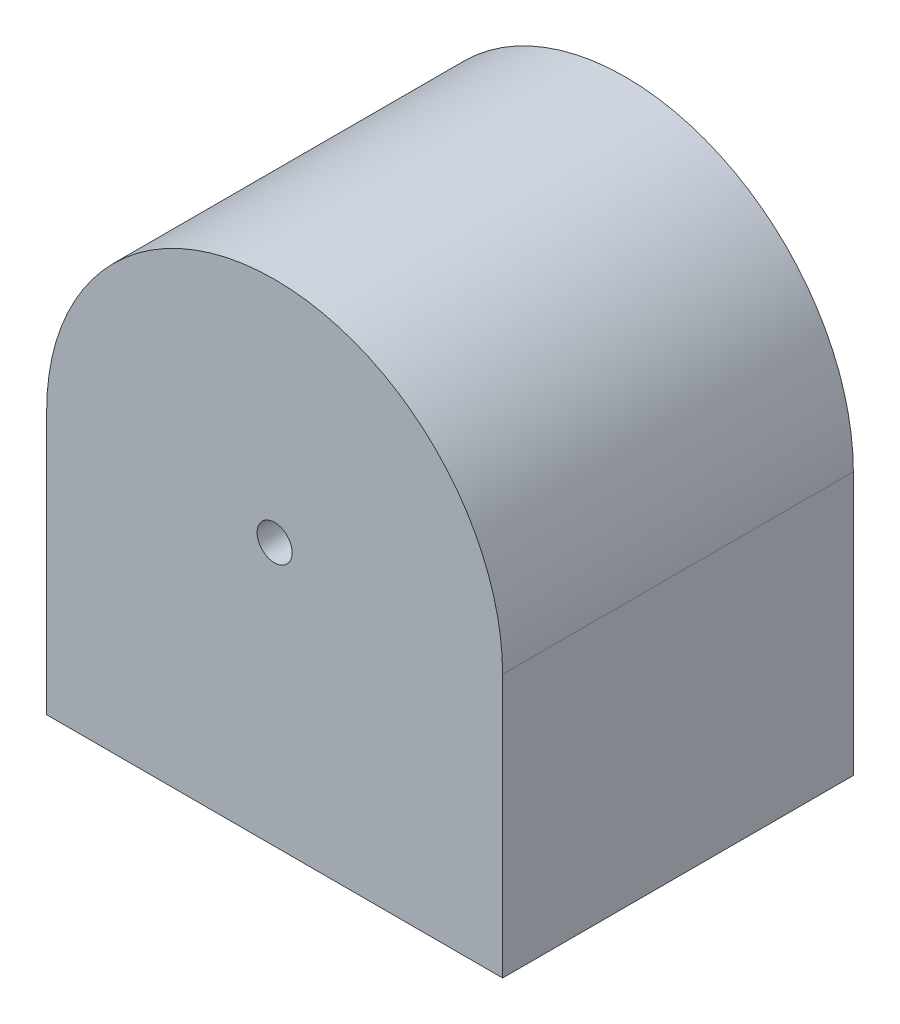
ISO-10303-21;
HEADER;
FILE_DESCRIPTION(('STEP AP214'),'2;1');
FILE_NAME('part.step','',(''),(''),'','','');
FILE_SCHEMA(('AUTOMOTIVE_DESIGN { 1 0 10303 214 1 1 1 1 }'));
ENDSEC;
DATA;
#1=APPLICATION_CONTEXT('core data for automotive mechanical design processes');
#2=APPLICATION_PROTOCOL_DEFINITION('international standard','automotive_design',2000,#1);
#3=PRODUCT_CONTEXT('',#1,'mechanical');
#4=PRODUCT('Part','Part','',(#3));
#5=PRODUCT_RELATED_PRODUCT_CATEGORY('part','',(#4));
#6=PRODUCT_DEFINITION_FORMATION('','',#4);
#7=PRODUCT_DEFINITION_CONTEXT('part definition',#1,'design');
#8=PRODUCT_DEFINITION('design','',#6,#7);
#9=PRODUCT_DEFINITION_SHAPE('','',#8);
#10=(LENGTH_UNIT() NAMED_UNIT(*) SI_UNIT(.MILLI.,.METRE.));
#11=(NAMED_UNIT(*) PLANE_ANGLE_UNIT() SI_UNIT($,.RADIAN.));
#12=(NAMED_UNIT(*) SI_UNIT($,.STERADIAN.) SOLID_ANGLE_UNIT());
#13=UNCERTAINTY_MEASURE_WITH_UNIT(LENGTH_MEASURE(1.E-05),#10,'distance_accuracy_value','');
#14=(GEOMETRIC_REPRESENTATION_CONTEXT(3) GLOBAL_UNCERTAINTY_ASSIGNED_CONTEXT((#13)) GLOBAL_UNIT_ASSIGNED_CONTEXT((#10,
#11,#12)) REPRESENTATION_CONTEXT('',''));
#15=CARTESIAN_POINT('',(0.,0.,0.));
#16=DIRECTION('',(0.,0.,1.));
#17=DIRECTION('',(1.,0.,0.));
#18=AXIS2_PLACEMENT_3D('',#15,#16,#17);
#19=CARTESIAN_POINT('',(0.,-75.,100.));
#20=DIRECTION('',(0.,1.,0.));
#21=DIRECTION('',(0.,0.,1.));
#22=AXIS2_PLACEMENT_3D('',#19,#20,#21);
#23=PLANE('',#22);
#24=DIRECTION('',(1.,0.,0.));
#25=VECTOR('',#24,1.);
#26=CARTESIAN_POINT('',(0.,-75.,0.));
#27=LINE('',#26,#25);
#28=CARTESIAN_POINT('',(-65.,-75.,0.));
#29=VERTEX_POINT('',#28);
#30=CARTESIAN_POINT('',(65.,-75.,0.));
#31=VERTEX_POINT('',#30);
#32=EDGE_CURVE('E91',#29,#31,#27,.T.);
#33=ORIENTED_EDGE('',*,*,#32,.T.);
#34=DIRECTION('',(0.,0.,-1.));
#35=VECTOR('',#34,1.);
#36=CARTESIAN_POINT('',(65.,-75.,100.));
#37=LINE('',#36,#35);
#38=CARTESIAN_POINT('',(65.,-75.,100.));
#39=VERTEX_POINT('',#38);
#40=EDGE_CURVE('E11',#39,#31,#37,.T.);
#41=ORIENTED_EDGE('',*,*,#40,.F.);
#42=DIRECTION('',(-1.,0.,0.));
#43=VECTOR('',#42,1.);
#44=CARTESIAN_POINT('',(0.,-75.,100.));
#45=LINE('',#44,#43);
#46=CARTESIAN_POINT('',(-65.,-75.,100.));
#47=VERTEX_POINT('',#46);
#48=EDGE_CURVE('E172',#39,#47,#45,.T.);
#49=ORIENTED_EDGE('',*,*,#48,.T.);
#50=DIRECTION('',(0.,0.,-1.));
#51=VECTOR('',#50,1.);
#52=CARTESIAN_POINT('',(-65.,-75.,100.));
#53=LINE('',#52,#51);
#54=EDGE_CURVE('E96',#47,#29,#53,.T.);
#55=ORIENTED_EDGE('',*,*,#54,.T.);
#56=EDGE_LOOP('',(#33,#41,#49,#55));
#57=FACE_BOUND('',#56,.T.);
#58=DIRECTION('',(1.,0.,0.));
#59=VECTOR('',#58,1.);
#60=CARTESIAN_POINT('',(0.,-75.,9.99999999999999));
#61=LINE('',#60,#59);
#62=CARTESIAN_POINT('',(-55.,-75.,10.));
#63=VERTEX_POINT('',#62);
#64=CARTESIAN_POINT('',(55.,-75.,10.));
#65=VERTEX_POINT('',#64);
#66=EDGE_CURVE('E125',#63,#65,#61,.T.);
#67=ORIENTED_EDGE('',*,*,#66,.F.);
#68=DIRECTION('',(0.,0.,-1.));
#69=VECTOR('',#68,1.);
#70=CARTESIAN_POINT('',(-55.,-75.,100.));
#71=LINE('',#70,#69);
#72=CARTESIAN_POINT('',(-55.,-75.,90.));
#73=VERTEX_POINT('',#72);
#74=EDGE_CURVE('E155',#73,#63,#71,.T.);
#75=ORIENTED_EDGE('',*,*,#74,.F.);
#76=DIRECTION('',(-1.,0.,0.));
#77=VECTOR('',#76,1.);
#78=CARTESIAN_POINT('',(0.,-75.,90.));
#79=LINE('',#78,#77);
#80=CARTESIAN_POINT('',(55.,-75.,90.));
#81=VERTEX_POINT('',#80);
#82=EDGE_CURVE('E61',#81,#73,#79,.T.);
#83=ORIENTED_EDGE('',*,*,#82,.F.);
#84=DIRECTION('',(0.,0.,-1.));
#85=VECTOR('',#84,1.);
#86=CARTESIAN_POINT('',(55.,-75.,100.));
#87=LINE('',#86,#85);
#88=EDGE_CURVE('E139',#81,#65,#87,.T.);
#89=ORIENTED_EDGE('',*,*,#88,.T.);
#90=EDGE_LOOP('',(#67,#75,#83,#89));
#91=FACE_BOUND('',#90,.T.);
#92=ADVANCED_FACE('F43',(#57,#91),#23,.F.);
#93=CARTESIAN_POINT('',(65.,-75.,100.));
#94=DIRECTION('',(-1.,0.,0.));
#95=DIRECTION('',(0.,0.,1.));
#96=AXIS2_PLACEMENT_3D('',#93,#94,#95);
#97=PLANE('',#96);
#98=DIRECTION('',(0.,1.,0.));
#99=VECTOR('',#98,1.);
#100=CARTESIAN_POINT('',(65.,-75.,0.));
#101=LINE('',#100,#99);
#102=CARTESIAN_POINT('',(65.,0.,0.));
#103=VERTEX_POINT('',#102);
#104=EDGE_CURVE('E190',#31,#103,#101,.T.);
#105=ORIENTED_EDGE('',*,*,#104,.T.);
#106=DIRECTION('',(0.,0.,-1.));
#107=VECTOR('',#106,1.);
#108=CARTESIAN_POINT('',(65.,0.,100.));
#109=LINE('',#108,#107);
#110=CARTESIAN_POINT('',(65.,0.,100.));
#111=VERTEX_POINT('',#110);
#112=EDGE_CURVE('E53',#111,#103,#109,.T.);
#113=ORIENTED_EDGE('',*,*,#112,.F.);
#114=DIRECTION('',(0.,1.,0.));
#115=VECTOR('',#114,1.);
#116=CARTESIAN_POINT('',(65.,-65.,100.));
#117=LINE('',#116,#115);
#118=EDGE_CURVE('E69',#39,#111,#117,.T.);
#119=ORIENTED_EDGE('',*,*,#118,.F.);
#120=ORIENTED_EDGE('',*,*,#40,.T.);
#121=EDGE_LOOP('',(#105,#113,#119,#120));
#122=FACE_BOUND('',#121,.T.);
#123=ADVANCED_FACE('F213',(#122),#97,.F.);
#124=CARTESIAN_POINT('',(0.,0.,100.));
#125=DIRECTION('',(0.,0.,-1.));
#126=DIRECTION('',(-1.,0.,0.));
#127=AXIS2_PLACEMENT_3D('',#124,#125,#126);
#128=CYLINDRICAL_SURFACE('',#127,65.);
#129=CARTESIAN_POINT('',(0.,0.,0.));
#130=DIRECTION('',(0.,0.,1.));
#131=DIRECTION('',(1.,0.,0.));
#132=AXIS2_PLACEMENT_3D('',#129,#130,#131);
#133=CIRCLE('',#132,65.);
#134=CARTESIAN_POINT('',(-65.,0.,0.));
#135=VERTEX_POINT('',#134);
#136=EDGE_CURVE('E187',#103,#135,#133,.T.);
#137=ORIENTED_EDGE('',*,*,#136,.T.);
#138=DIRECTION('',(0.,0.,-1.));
#139=VECTOR('',#138,1.);
#140=CARTESIAN_POINT('',(-65.,0.,100.));
#141=LINE('',#140,#139);
#142=CARTESIAN_POINT('',(-65.,0.,100.));
#143=VERTEX_POINT('',#142);
#144=EDGE_CURVE('E198',#143,#135,#141,.T.);
#145=ORIENTED_EDGE('',*,*,#144,.F.);
#146=CARTESIAN_POINT('',(0.,0.,100.));
#147=DIRECTION('',(0.,0.,1.));
#148=DIRECTION('',(1.,0.,0.));
#149=AXIS2_PLACEMENT_3D('',#146,#147,#148);
#150=CIRCLE('',#149,65.);
#151=EDGE_CURVE('E179',#111,#143,#150,.T.);
#152=ORIENTED_EDGE('',*,*,#151,.F.);
#153=ORIENTED_EDGE('',*,*,#112,.T.);
#154=EDGE_LOOP('',(#137,#145,#152,#153));
#155=FACE_BOUND('',#154,.T.);
#156=ADVANCED_FACE('F214',(#155),#128,.T.);
#157=CARTESIAN_POINT('',(-65.,0.,100.));
#158=DIRECTION('',(1.,0.,0.));
#159=DIRECTION('',(0.,0.,-1.));
#160=AXIS2_PLACEMENT_3D('',#157,#158,#159);
#161=PLANE('',#160);
#162=DIRECTION('',(0.,-1.,0.));
#163=VECTOR('',#162,1.);
#164=CARTESIAN_POINT('',(-65.,0.,0.));
#165=LINE('',#164,#163);
#166=EDGE_CURVE('E164',#135,#29,#165,.T.);
#167=ORIENTED_EDGE('',*,*,#166,.T.);
#168=ORIENTED_EDGE('',*,*,#54,.F.);
#169=DIRECTION('',(0.,1.,0.));
#170=VECTOR('',#169,1.);
#171=CARTESIAN_POINT('',(-65.,-75.,100.));
#172=LINE('',#171,#170);
#173=EDGE_CURVE('E176',#47,#143,#172,.T.);
#174=ORIENTED_EDGE('',*,*,#173,.T.);
#175=ORIENTED_EDGE('',*,*,#144,.T.);
#176=EDGE_LOOP('',(#167,#168,#174,#175));
#177=FACE_BOUND('',#176,.T.);
#178=ADVANCED_FACE('F45',(#177),#161,.F.);
#179=CARTESIAN_POINT('',(0.,0.,100.));
#180=DIRECTION('',(0.,0.,1.));
#181=DIRECTION('',(1.,0.,0.));
#182=AXIS2_PLACEMENT_3D('',#179,#180,#181);
#183=PLANE('',#182);
#184=CARTESIAN_POINT('',(0.,0.,100.));
#185=DIRECTION('',(0.,0.,1.));
#186=DIRECTION('',(1.,0.,0.));
#187=AXIS2_PLACEMENT_3D('',#184,#185,#186);
#188=CIRCLE('',#187,5.);
#189=CARTESIAN_POINT('',(5.,0.,100.));
#190=VERTEX_POINT('',#189);
#191=EDGE_CURVE('E267',#190,#190,#188,.T.);
#192=ORIENTED_EDGE('',*,*,#191,.F.);
#193=EDGE_LOOP('',(#192));
#194=FACE_BOUND('',#193,.T.);
#195=ORIENTED_EDGE('',*,*,#48,.F.);
#196=ORIENTED_EDGE('',*,*,#118,.T.);
#197=ORIENTED_EDGE('',*,*,#151,.T.);
#198=ORIENTED_EDGE('',*,*,#173,.F.);
#199=EDGE_LOOP('',(#195,#196,#197,#198));
#200=FACE_BOUND('',#199,.T.);
#201=ADVANCED_FACE('F204',(#194,#200),#183,.T.);
#202=CARTESIAN_POINT('',(0.,0.,0.));
#203=DIRECTION('',(0.,0.,1.));
#204=DIRECTION('',(1.,0.,0.));
#205=AXIS2_PLACEMENT_3D('',#202,#203,#204);
#206=PLANE('',#205);
#207=CARTESIAN_POINT('',(0.,0.,0.));
#208=DIRECTION('',(0.,0.,1.));
#209=DIRECTION('',(1.,0.,0.));
#210=AXIS2_PLACEMENT_3D('',#207,#208,#209);
#211=CIRCLE('',#210,5.);
#212=CARTESIAN_POINT('',(5.,0.,0.));
#213=VERTEX_POINT('',#212);
#214=EDGE_CURVE('E149',#213,#213,#211,.T.);
#215=ORIENTED_EDGE('',*,*,#214,.T.);
#216=EDGE_LOOP('',(#215));
#217=FACE_BOUND('',#216,.T.);
#218=ORIENTED_EDGE('',*,*,#32,.F.);
#219=ORIENTED_EDGE('',*,*,#166,.F.);
#220=ORIENTED_EDGE('',*,*,#136,.F.);
#221=ORIENTED_EDGE('',*,*,#104,.F.);
#222=EDGE_LOOP('',(#218,#219,#220,#221));
#223=FACE_BOUND('',#222,.T.);
#224=ADVANCED_FACE('F211',(#217,#223),#206,.F.);
#225=CARTESIAN_POINT('',(55.,-75.,100.));
#226=DIRECTION('',(-1.,0.,0.));
#227=DIRECTION('',(0.,0.,1.));
#228=AXIS2_PLACEMENT_3D('',#225,#226,#227);
#229=PLANE('',#228);
#230=DIRECTION('',(0.,1.,0.));
#231=VECTOR('',#230,1.);
#232=CARTESIAN_POINT('',(55.,-75.,9.99999999999999));
#233=LINE('',#232,#231);
#234=CARTESIAN_POINT('',(55.,0.,9.99999999999999));
#235=VERTEX_POINT('',#234);
#236=EDGE_CURVE('E118',#65,#235,#233,.T.);
#237=ORIENTED_EDGE('',*,*,#236,.F.);
#238=ORIENTED_EDGE('',*,*,#88,.F.);
#239=DIRECTION('',(0.,1.,0.));
#240=VECTOR('',#239,1.);
#241=CARTESIAN_POINT('',(55.,-75.,90.));
#242=LINE('',#241,#240);
#243=CARTESIAN_POINT('',(55.,0.,90.));
#244=VERTEX_POINT('',#243);
#245=EDGE_CURVE('E134',#81,#244,#242,.T.);
#246=ORIENTED_EDGE('',*,*,#245,.T.);
#247=DIRECTION('',(0.,0.,-1.));
#248=VECTOR('',#247,1.);
#249=CARTESIAN_POINT('',(55.,0.,100.));
#250=LINE('',#249,#248);
#251=EDGE_CURVE('E132',#244,#235,#250,.T.);
#252=ORIENTED_EDGE('',*,*,#251,.T.);
#253=EDGE_LOOP('',(#237,#238,#246,#252));
#254=FACE_BOUND('',#253,.T.);
#255=ADVANCED_FACE('F133',(#254),#229,.T.);
#256=CARTESIAN_POINT('',(0.,0.,100.));
#257=DIRECTION('',(0.,0.,-1.));
#258=DIRECTION('',(-1.,0.,0.));
#259=AXIS2_PLACEMENT_3D('',#256,#257,#258);
#260=CYLINDRICAL_SURFACE('',#259,55.);
#261=CARTESIAN_POINT('',(0.,0.,9.99999999999999));
#262=DIRECTION('',(0.,0.,1.));
#263=DIRECTION('',(1.,0.,0.));
#264=AXIS2_PLACEMENT_3D('',#261,#262,#263);
#265=CIRCLE('',#264,55.);
#266=CARTESIAN_POINT('',(-55.,0.,9.99999999999999));
#267=VERTEX_POINT('',#266);
#268=EDGE_CURVE('E122',#235,#267,#265,.T.);
#269=ORIENTED_EDGE('',*,*,#268,.F.);
#270=ORIENTED_EDGE('',*,*,#251,.F.);
#271=CARTESIAN_POINT('',(0.,0.,90.));
#272=DIRECTION('',(0.,0.,1.));
#273=DIRECTION('',(1.,0.,0.));
#274=AXIS2_PLACEMENT_3D('',#271,#272,#273);
#275=CIRCLE('',#274,55.);
#276=CARTESIAN_POINT('',(-55.,0.,90.));
#277=VERTEX_POINT('',#276);
#278=EDGE_CURVE('E156',#244,#277,#275,.T.);
#279=ORIENTED_EDGE('',*,*,#278,.T.);
#280=DIRECTION('',(0.,0.,-1.));
#281=VECTOR('',#280,1.);
#282=CARTESIAN_POINT('',(-55.,0.,100.));
#283=LINE('',#282,#281);
#284=EDGE_CURVE('E140',#277,#267,#283,.T.);
#285=ORIENTED_EDGE('',*,*,#284,.T.);
#286=EDGE_LOOP('',(#269,#270,#279,#285));
#287=FACE_BOUND('',#286,.T.);
#288=ADVANCED_FACE('F142',(#287),#260,.F.);
#289=CARTESIAN_POINT('',(-55.,0.,100.));
#290=DIRECTION('',(1.,0.,0.));
#291=DIRECTION('',(0.,0.,-1.));
#292=AXIS2_PLACEMENT_3D('',#289,#290,#291);
#293=PLANE('',#292);
#294=DIRECTION('',(0.,-1.,0.));
#295=VECTOR('',#294,1.);
#296=CARTESIAN_POINT('',(-55.,0.,9.99999999999999));
#297=LINE('',#296,#295);
#298=EDGE_CURVE('E146',#267,#63,#297,.T.);
#299=ORIENTED_EDGE('',*,*,#298,.F.);
#300=ORIENTED_EDGE('',*,*,#284,.F.);
#301=DIRECTION('',(0.,1.,0.));
#302=VECTOR('',#301,1.);
#303=CARTESIAN_POINT('',(-55.,0.,90.));
#304=LINE('',#303,#302);
#305=EDGE_CURVE('E158',#73,#277,#304,.T.);
#306=ORIENTED_EDGE('',*,*,#305,.F.);
#307=ORIENTED_EDGE('',*,*,#74,.T.);
#308=EDGE_LOOP('',(#299,#300,#306,#307));
#309=FACE_BOUND('',#308,.T.);
#310=ADVANCED_FACE('F239',(#309),#293,.T.);
#311=CARTESIAN_POINT('',(0.,0.,90.));
#312=DIRECTION('',(0.,0.,1.));
#313=DIRECTION('',(1.,0.,0.));
#314=AXIS2_PLACEMENT_3D('',#311,#312,#313);
#315=PLANE('',#314);
#316=CARTESIAN_POINT('',(0.,0.,90.));
#317=DIRECTION('',(0.,0.,1.));
#318=DIRECTION('',(1.,0.,0.));
#319=AXIS2_PLACEMENT_3D('',#316,#317,#318);
#320=CIRCLE('',#319,5.);
#321=CARTESIAN_POINT('',(5.,0.,90.));
#322=VERTEX_POINT('',#321);
#323=EDGE_CURVE('E261',#322,#322,#320,.T.);
#324=ORIENTED_EDGE('',*,*,#323,.T.);
#325=EDGE_LOOP('',(#324));
#326=FACE_BOUND('',#325,.T.);
#327=ORIENTED_EDGE('',*,*,#82,.T.);
#328=ORIENTED_EDGE('',*,*,#305,.T.);
#329=ORIENTED_EDGE('',*,*,#278,.F.);
#330=ORIENTED_EDGE('',*,*,#245,.F.);
#331=EDGE_LOOP('',(#327,#328,#329,#330));
#332=FACE_BOUND('',#331,.T.);
#333=ADVANCED_FACE('F235',(#326,#332),#315,.F.);
#334=CARTESIAN_POINT('',(0.,0.,10.));
#335=DIRECTION('',(0.,0.,1.));
#336=DIRECTION('',(1.,0.,0.));
#337=AXIS2_PLACEMENT_3D('',#334,#335,#336);
#338=PLANE('',#337);
#339=CARTESIAN_POINT('',(0.,0.,10.));
#340=DIRECTION('',(0.,0.,1.));
#341=DIRECTION('',(1.,0.,0.));
#342=AXIS2_PLACEMENT_3D('',#339,#340,#341);
#343=CIRCLE('',#342,5.);
#344=CARTESIAN_POINT('',(5.,0.,10.));
#345=VERTEX_POINT('',#344);
#346=EDGE_CURVE('E47',#345,#345,#343,.T.);
#347=ORIENTED_EDGE('',*,*,#346,.F.);
#348=EDGE_LOOP('',(#347));
#349=FACE_BOUND('',#348,.T.);
#350=ORIENTED_EDGE('',*,*,#66,.T.);
#351=ORIENTED_EDGE('',*,*,#236,.T.);
#352=ORIENTED_EDGE('',*,*,#268,.T.);
#353=ORIENTED_EDGE('',*,*,#298,.T.);
#354=EDGE_LOOP('',(#350,#351,#352,#353));
#355=FACE_BOUND('',#354,.T.);
#356=ADVANCED_FACE('F120',(#349,#355),#338,.T.);
#357=CARTESIAN_POINT('',(0.,0.,-30.));
#358=DIRECTION('',(0.,0.,1.));
#359=DIRECTION('',(1.,0.,0.));
#360=AXIS2_PLACEMENT_3D('',#357,#358,#359);
#361=CYLINDRICAL_SURFACE('',#360,5.);
#362=ORIENTED_EDGE('',*,*,#346,.T.);
#363=EDGE_LOOP('',(#362));
#364=FACE_BOUND('',#363,.T.);
#365=ORIENTED_EDGE('',*,*,#214,.F.);
#366=EDGE_LOOP('',(#365));
#367=FACE_BOUND('',#366,.T.);
#368=ADVANCED_FACE('F234',(#364,#367),#361,.F.);
#369=ORIENTED_EDGE('',*,*,#191,.T.);
#370=EDGE_LOOP('',(#369));
#371=FACE_BOUND('',#370,.T.);
#372=ORIENTED_EDGE('',*,*,#323,.F.);
#373=EDGE_LOOP('',(#372));
#374=FACE_BOUND('',#373,.T.);
#375=ADVANCED_FACE('F249',(#371,#374),#361,.F.);
#376=CLOSED_SHELL('',(#92,#123,#156,#178,#201,#224,#255,#288,#310,#333,#356,#368,#375));
#377=MANIFOLD_SOLID_BREP('B2',#376);
#378=ADVANCED_BREP_SHAPE_REPRESENTATION('',(#18,#377),#14);
#379=SHAPE_DEFINITION_REPRESENTATION(#9,#378);
ENDSEC;
END-ISO-10303-21;
